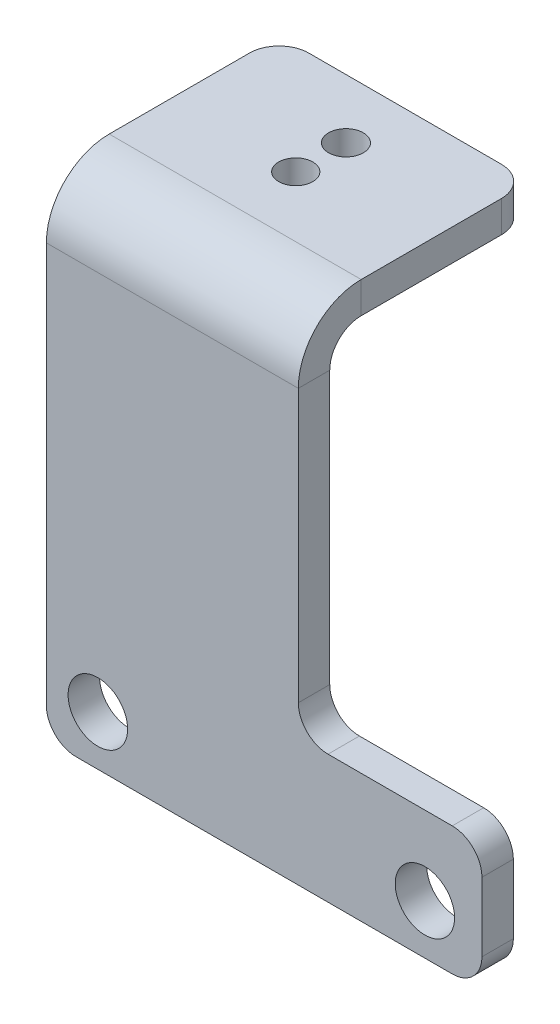
ISO-10303-21;
HEADER;
FILE_DESCRIPTION(('STEP AP214'),'2;1');
FILE_NAME('part.step','',(''),(''),'','','');
FILE_SCHEMA(('AUTOMOTIVE_DESIGN { 1 0 10303 214 1 1 1 1 }'));
ENDSEC;
DATA;
#1=APPLICATION_CONTEXT('core data for automotive mechanical design processes');
#2=APPLICATION_PROTOCOL_DEFINITION('international standard','automotive_design',2000,#1);
#3=PRODUCT_CONTEXT('',#1,'mechanical');
#4=PRODUCT('Part','Part','',(#3));
#5=PRODUCT_RELATED_PRODUCT_CATEGORY('part','',(#4));
#6=PRODUCT_DEFINITION_FORMATION('','',#4);
#7=PRODUCT_DEFINITION_CONTEXT('part definition',#1,'design');
#8=PRODUCT_DEFINITION('design','',#6,#7);
#9=PRODUCT_DEFINITION_SHAPE('','',#8);
#10=(LENGTH_UNIT() NAMED_UNIT(*) SI_UNIT(.MILLI.,.METRE.));
#11=(NAMED_UNIT(*) PLANE_ANGLE_UNIT() SI_UNIT($,.RADIAN.));
#12=(NAMED_UNIT(*) SI_UNIT($,.STERADIAN.) SOLID_ANGLE_UNIT());
#13=UNCERTAINTY_MEASURE_WITH_UNIT(LENGTH_MEASURE(1.E-05),#10,'distance_accuracy_value','');
#14=(GEOMETRIC_REPRESENTATION_CONTEXT(3) GLOBAL_UNCERTAINTY_ASSIGNED_CONTEXT((#13)) GLOBAL_UNIT_ASSIGNED_CONTEXT((#10,
#11,#12)) REPRESENTATION_CONTEXT('',''));
#15=CARTESIAN_POINT('',(0.,0.,0.));
#16=DIRECTION('',(0.,0.,1.));
#17=DIRECTION('',(1.,0.,0.));
#18=AXIS2_PLACEMENT_3D('',#15,#16,#17);
#19=CARTESIAN_POINT('',(3.45480441202994,34.9392859469571,3.175));
#20=DIRECTION('',(1.,0.,0.));
#21=DIRECTION('',(0.,-1.,0.));
#22=AXIS2_PLACEMENT_3D('',#19,#20,#21);
#23=PLANE('',#22);
#24=DIRECTION('',(0.,-1.,0.));
#25=VECTOR('',#24,1.);
#26=CARTESIAN_POINT('',(3.45480441202994,34.9392859469571,3.175));
#27=LINE('',#26,#25);
#28=CARTESIAN_POINT('',(3.45480441202994,28.5892859469571,3.175));
#29=VERTEX_POINT('',#28);
#30=CARTESIAN_POINT('',(3.45480441202994,1.07217449617358,3.175));
#31=VERTEX_POINT('',#30);
#32=EDGE_CURVE('E249',#29,#31,#27,.T.);
#33=ORIENTED_EDGE('',*,*,#32,.T.);
#34=DIRECTION('',(0.,0.,1.));
#35=VECTOR('',#34,1.);
#36=CARTESIAN_POINT('',(3.45480441202994,1.07217449617358,0.));
#37=LINE('',#36,#35);
#38=CARTESIAN_POINT('',(3.45480441202994,1.07217449617358,0.));
#39=VERTEX_POINT('',#38);
#40=EDGE_CURVE('E307',#31,#39,#37,.F.);
#41=ORIENTED_EDGE('',*,*,#40,.T.);
#42=DIRECTION('',(0.,1.,0.));
#43=VECTOR('',#42,1.);
#44=CARTESIAN_POINT('',(3.45480441202994,0.,0.));
#45=LINE('',#44,#43);
#46=CARTESIAN_POINT('',(3.45480441202994,28.5892859469571,0.));
#47=VERTEX_POINT('',#46);
#48=EDGE_CURVE('E260',#47,#39,#45,.F.);
#49=ORIENTED_EDGE('',*,*,#48,.F.);
#50=DIRECTION('',(0.,0.,1.));
#51=VECTOR('',#50,1.);
#52=CARTESIAN_POINT('',(3.45480441202994,28.5892859469571,0.));
#53=LINE('',#52,#51);
#54=EDGE_CURVE('E228',#47,#29,#53,.T.);
#55=ORIENTED_EDGE('',*,*,#54,.T.);
#56=EDGE_LOOP('',(#33,#41,#49,#55));
#57=FACE_BOUND('',#56,.T.);
#58=ADVANCED_FACE('F58',(#57),#23,.T.);
#59=CARTESIAN_POINT('',(0.,0.,3.175));
#60=DIRECTION('',(0.,0.,-1.));
#61=DIRECTION('',(-1.,0.,0.));
#62=AXIS2_PLACEMENT_3D('',#59,#60,#61);
#63=PLANE('',#62);
#64=CARTESIAN_POINT('',(16.2484432255354,-9.86712213835972,3.175));
#65=DIRECTION('',(0.,0.,1.));
#66=DIRECTION('',(1.,0.,0.));
#67=AXIS2_PLACEMENT_3D('',#64,#65,#66);
#68=CIRCLE('',#67,3.);
#69=CARTESIAN_POINT('',(19.2484432255354,-9.86712213835972,3.175));
#70=VERTEX_POINT('',#69);
#71=EDGE_CURVE('E351',#70,#70,#68,.T.);
#72=ORIENTED_EDGE('',*,*,#71,.F.);
#73=EDGE_LOOP('',(#72));
#74=FACE_BOUND('',#73,.T.);
#75=CARTESIAN_POINT('',(-16.8054258844315,-9.86712213835972,3.175));
#76=DIRECTION('',(0.,0.,1.));
#77=DIRECTION('',(1.,0.,0.));
#78=AXIS2_PLACEMENT_3D('',#75,#76,#77);
#79=CIRCLE('',#78,3.00853912662545);
#80=CARTESIAN_POINT('',(-13.796886757806,-9.86712213835972,3.175));
#81=VERTEX_POINT('',#80);
#82=EDGE_CURVE('E345',#81,#81,#79,.T.);
#83=ORIENTED_EDGE('',*,*,#82,.F.);
#84=EDGE_LOOP('',(#83));
#85=FACE_BOUND('',#84,.T.);
#86=DIRECTION('',(0.,-1.,0.));
#87=VECTOR('',#86,1.);
#88=CARTESIAN_POINT('',(-22.0098424053222,-34.9392859469571,3.175));
#89=LINE('',#88,#87);
#90=CARTESIAN_POINT('',(-22.0098424053222,28.5892859469571,3.175));
#91=VERTEX_POINT('',#90);
#92=CARTESIAN_POINT('',(-22.0098424053222,-11.8898519571061,3.175));
#93=VERTEX_POINT('',#92);
#94=EDGE_CURVE('E252',#91,#93,#89,.T.);
#95=ORIENTED_EDGE('',*,*,#94,.T.);
#96=CARTESIAN_POINT('',(-19.0098424053222,-11.8898519571061,3.175));
#97=DIRECTION('',(0.,0.,-1.));
#98=DIRECTION('',(-1.,0.,0.));
#99=AXIS2_PLACEMENT_3D('',#96,#97,#98);
#100=CIRCLE('',#99,3.);
#101=CARTESIAN_POINT('',(-19.0098424053222,-14.8898519571061,3.175));
#102=VERTEX_POINT('',#101);
#103=EDGE_CURVE('E286',#93,#102,#100,.F.);
#104=ORIENTED_EDGE('',*,*,#103,.T.);
#105=DIRECTION('',(-1.,0.,0.));
#106=VECTOR('',#105,1.);
#107=CARTESIAN_POINT('',(-22.0098424053222,-14.8898519571061,3.175));
#108=LINE('',#107,#106);
#109=CARTESIAN_POINT('',(19.0098424053222,-14.8898519571061,3.175));
#110=VERTEX_POINT('',#109);
#111=EDGE_CURVE('E331',#110,#102,#108,.T.);
#112=ORIENTED_EDGE('',*,*,#111,.F.);
#113=CARTESIAN_POINT('',(19.0098424053222,-11.8898519571061,3.175));
#114=DIRECTION('',(0.,0.,-1.));
#115=DIRECTION('',(-1.,0.,0.));
#116=AXIS2_PLACEMENT_3D('',#113,#114,#115);
#117=CIRCLE('',#116,3.);
#118=CARTESIAN_POINT('',(22.0098424053222,-11.8898519571061,3.175));
#119=VERTEX_POINT('',#118);
#120=EDGE_CURVE('E284',#110,#119,#117,.F.);
#121=ORIENTED_EDGE('',*,*,#120,.T.);
#122=DIRECTION('',(0.,1.,0.));
#123=VECTOR('',#122,1.);
#124=CARTESIAN_POINT('',(22.0098424053222,-34.9392859469571,3.175));
#125=LINE('',#124,#123);
#126=CARTESIAN_POINT('',(22.0098424053222,-4.92782550382642,3.175));
#127=VERTEX_POINT('',#126);
#128=EDGE_CURVE('E242',#119,#127,#125,.T.);
#129=ORIENTED_EDGE('',*,*,#128,.T.);
#130=CARTESIAN_POINT('',(19.0098424053222,-4.92782550382642,3.175));
#131=DIRECTION('',(0.,0.,-1.));
#132=DIRECTION('',(-1.,0.,0.));
#133=AXIS2_PLACEMENT_3D('',#130,#131,#132);
#134=CIRCLE('',#133,3.);
#135=CARTESIAN_POINT('',(19.0098424053222,-1.92782550382642,3.175));
#136=VERTEX_POINT('',#135);
#137=EDGE_CURVE('E282',#127,#136,#134,.F.);
#138=ORIENTED_EDGE('',*,*,#137,.T.);
#139=DIRECTION('',(1.,0.,0.));
#140=VECTOR('',#139,1.);
#141=CARTESIAN_POINT('',(3.45480441202994,-1.92782550382642,3.175));
#142=LINE('',#141,#140);
#143=CARTESIAN_POINT('',(6.45480441202994,-1.92782550382642,3.175));
#144=VERTEX_POINT('',#143);
#145=EDGE_CURVE('E245',#144,#136,#142,.T.);
#146=ORIENTED_EDGE('',*,*,#145,.F.);
#147=CARTESIAN_POINT('',(6.45480441202994,1.07217449617358,3.175));
#148=DIRECTION('',(0.,0.,-1.));
#149=DIRECTION('',(-1.,0.,0.));
#150=AXIS2_PLACEMENT_3D('',#147,#148,#149);
#151=CIRCLE('',#150,3.);
#152=EDGE_CURVE('E66',#144,#31,#151,.T.);
#153=ORIENTED_EDGE('',*,*,#152,.T.);
#154=ORIENTED_EDGE('',*,*,#32,.F.);
#155=DIRECTION('',(1.,0.,0.));
#156=VECTOR('',#155,1.);
#157=CARTESIAN_POINT('',(3.45480441202994,28.5892859469571,3.175));
#158=LINE('',#157,#156);
#159=EDGE_CURVE('E180',#29,#91,#158,.F.);
#160=ORIENTED_EDGE('',*,*,#159,.T.);
#161=EDGE_LOOP('',(#95,#104,#112,#121,#129,#138,#146,#153,#154,#160));
#162=FACE_BOUND('',#161,.T.);
#163=ADVANCED_FACE('F311',(#74,#85,#162),#63,.F.);
#164=CARTESIAN_POINT('',(0.,0.,0.));
#165=DIRECTION('',(0.,0.,-1.));
#166=DIRECTION('',(-1.,0.,0.));
#167=AXIS2_PLACEMENT_3D('',#164,#165,#166);
#168=PLANE('',#167);
#169=CARTESIAN_POINT('',(16.2484432255354,-9.86712213835972,0.));
#170=DIRECTION('',(0.,0.,1.));
#171=DIRECTION('',(1.,0.,0.));
#172=AXIS2_PLACEMENT_3D('',#169,#170,#171);
#173=CIRCLE('',#172,3.);
#174=CARTESIAN_POINT('',(19.2484432255354,-9.86712213835972,0.));
#175=VERTEX_POINT('',#174);
#176=EDGE_CURVE('E348',#175,#175,#173,.T.);
#177=ORIENTED_EDGE('',*,*,#176,.T.);
#178=EDGE_LOOP('',(#177));
#179=FACE_BOUND('',#178,.T.);
#180=CARTESIAN_POINT('',(-16.8054258844315,-9.86712213835972,0.));
#181=DIRECTION('',(0.,0.,1.));
#182=DIRECTION('',(1.,0.,0.));
#183=AXIS2_PLACEMENT_3D('',#180,#181,#182);
#184=CIRCLE('',#183,3.00853912662545);
#185=CARTESIAN_POINT('',(-13.796886757806,-9.86712213835972,0.));
#186=VERTEX_POINT('',#185);
#187=EDGE_CURVE('E342',#186,#186,#184,.T.);
#188=ORIENTED_EDGE('',*,*,#187,.T.);
#189=EDGE_LOOP('',(#188));
#190=FACE_BOUND('',#189,.T.);
#191=DIRECTION('',(-1.,0.,0.));
#192=VECTOR('',#191,1.);
#193=CARTESIAN_POINT('',(-22.0098424053222,-14.8898519571061,0.));
#194=LINE('',#193,#192);
#195=CARTESIAN_POINT('',(19.0098424053222,-14.8898519571061,0.));
#196=VERTEX_POINT('',#195);
#197=CARTESIAN_POINT('',(-19.0098424053222,-14.8898519571061,0.));
#198=VERTEX_POINT('',#197);
#199=EDGE_CURVE('E225',#196,#198,#194,.T.);
#200=ORIENTED_EDGE('',*,*,#199,.T.);
#201=CARTESIAN_POINT('',(-19.0098424053222,-11.8898519571061,0.));
#202=DIRECTION('',(0.,0.,-1.));
#203=DIRECTION('',(-1.,0.,0.));
#204=AXIS2_PLACEMENT_3D('',#201,#202,#203);
#205=CIRCLE('',#204,3.);
#206=CARTESIAN_POINT('',(-22.0098424053222,-11.8898519571061,0.));
#207=VERTEX_POINT('',#206);
#208=EDGE_CURVE('E296',#198,#207,#205,.T.);
#209=ORIENTED_EDGE('',*,*,#208,.T.);
#210=DIRECTION('',(0.,1.,0.));
#211=VECTOR('',#210,1.);
#212=CARTESIAN_POINT('',(-22.0098424053222,0.,0.));
#213=LINE('',#212,#211);
#214=CARTESIAN_POINT('',(-22.0098424053222,28.5892859469571,0.));
#215=VERTEX_POINT('',#214);
#216=EDGE_CURVE('E246',#215,#207,#213,.F.);
#217=ORIENTED_EDGE('',*,*,#216,.F.);
#218=DIRECTION('',(1.,0.,0.));
#219=VECTOR('',#218,1.);
#220=CARTESIAN_POINT('',(3.45480441202994,28.5892859469571,0.));
#221=LINE('',#220,#219);
#222=EDGE_CURVE('E232',#47,#215,#221,.F.);
#223=ORIENTED_EDGE('',*,*,#222,.F.);
#224=ORIENTED_EDGE('',*,*,#48,.T.);
#225=CARTESIAN_POINT('',(6.45480441202994,1.07217449617358,0.));
#226=DIRECTION('',(0.,0.,-1.));
#227=DIRECTION('',(-1.,0.,0.));
#228=AXIS2_PLACEMENT_3D('',#225,#226,#227);
#229=CIRCLE('',#228,3.);
#230=CARTESIAN_POINT('',(6.45480441202994,-1.92782550382642,0.));
#231=VERTEX_POINT('',#230);
#232=EDGE_CURVE('E13',#39,#231,#229,.F.);
#233=ORIENTED_EDGE('',*,*,#232,.T.);
#234=DIRECTION('',(-1.,0.,0.));
#235=VECTOR('',#234,1.);
#236=CARTESIAN_POINT('',(0.,-1.92782550382642,0.));
#237=LINE('',#236,#235);
#238=CARTESIAN_POINT('',(19.0098424053222,-1.92782550382642,0.));
#239=VERTEX_POINT('',#238);
#240=EDGE_CURVE('E257',#231,#239,#237,.F.);
#241=ORIENTED_EDGE('',*,*,#240,.T.);
#242=CARTESIAN_POINT('',(19.0098424053222,-4.92782550382642,0.));
#243=DIRECTION('',(0.,0.,-1.));
#244=DIRECTION('',(-1.,0.,0.));
#245=AXIS2_PLACEMENT_3D('',#242,#243,#244);
#246=CIRCLE('',#245,3.);
#247=CARTESIAN_POINT('',(22.0098424053222,-4.92782550382642,0.));
#248=VERTEX_POINT('',#247);
#249=EDGE_CURVE('E73',#239,#248,#246,.T.);
#250=ORIENTED_EDGE('',*,*,#249,.T.);
#251=DIRECTION('',(0.,1.,0.));
#252=VECTOR('',#251,1.);
#253=CARTESIAN_POINT('',(22.0098424053222,0.,0.));
#254=LINE('',#253,#252);
#255=CARTESIAN_POINT('',(22.0098424053222,-11.8898519571061,0.));
#256=VERTEX_POINT('',#255);
#257=EDGE_CURVE('E239',#256,#248,#254,.T.);
#258=ORIENTED_EDGE('',*,*,#257,.F.);
#259=CARTESIAN_POINT('',(19.0098424053222,-11.8898519571061,0.));
#260=DIRECTION('',(0.,0.,-1.));
#261=DIRECTION('',(-1.,0.,0.));
#262=AXIS2_PLACEMENT_3D('',#259,#260,#261);
#263=CIRCLE('',#262,3.);
#264=EDGE_CURVE('E294',#256,#196,#263,.T.);
#265=ORIENTED_EDGE('',*,*,#264,.T.);
#266=EDGE_LOOP('',(#200,#209,#217,#223,#224,#233,#241,#250,#258,#265));
#267=FACE_BOUND('',#266,.T.);
#268=ADVANCED_FACE('F321',(#179,#190,#267),#168,.T.);
#269=CARTESIAN_POINT('',(-22.0098424053222,-34.9392859469571,3.175));
#270=DIRECTION('',(1.,0.,0.));
#271=DIRECTION('',(0.,-1.,0.));
#272=AXIS2_PLACEMENT_3D('',#269,#270,#271);
#273=PLANE('',#272);
#274=ORIENTED_EDGE('',*,*,#216,.T.);
#275=DIRECTION('',(0.,0.,1.));
#276=VECTOR('',#275,1.);
#277=CARTESIAN_POINT('',(-22.0098424053222,-11.8898519571061,3.175));
#278=LINE('',#277,#276);
#279=EDGE_CURVE('E279',#207,#93,#278,.T.);
#280=ORIENTED_EDGE('',*,*,#279,.T.);
#281=ORIENTED_EDGE('',*,*,#94,.F.);
#282=DIRECTION('',(0.,0.,1.));
#283=VECTOR('',#282,1.);
#284=CARTESIAN_POINT('',(-22.0098424053222,28.5892859469571,0.));
#285=LINE('',#284,#283);
#286=EDGE_CURVE('E236',#215,#91,#285,.T.);
#287=ORIENTED_EDGE('',*,*,#286,.F.);
#288=EDGE_LOOP('',(#274,#280,#281,#287));
#289=FACE_BOUND('',#288,.T.);
#290=ADVANCED_FACE('F405',(#289),#273,.F.);
#291=CARTESIAN_POINT('',(22.0098424053222,-34.9392859469571,3.175));
#292=DIRECTION('',(-1.,0.,0.));
#293=DIRECTION('',(0.,1.,0.));
#294=AXIS2_PLACEMENT_3D('',#291,#292,#293);
#295=PLANE('',#294);
#296=ORIENTED_EDGE('',*,*,#128,.F.);
#297=DIRECTION('',(0.,0.,1.));
#298=VECTOR('',#297,1.);
#299=CARTESIAN_POINT('',(22.0098424053222,-11.8898519571061,0.));
#300=LINE('',#299,#298);
#301=EDGE_CURVE('E80',#119,#256,#300,.F.);
#302=ORIENTED_EDGE('',*,*,#301,.T.);
#303=ORIENTED_EDGE('',*,*,#257,.T.);
#304=DIRECTION('',(0.,0.,1.));
#305=VECTOR('',#304,1.);
#306=CARTESIAN_POINT('',(22.0098424053222,-4.92782550382642,3.175));
#307=LINE('',#306,#305);
#308=EDGE_CURVE('E298',#248,#127,#307,.T.);
#309=ORIENTED_EDGE('',*,*,#308,.T.);
#310=EDGE_LOOP('',(#296,#302,#303,#309));
#311=FACE_BOUND('',#310,.T.);
#312=ADVANCED_FACE('F328',(#311),#295,.F.);
#313=CARTESIAN_POINT('',(3.45480441202994,-1.92782550382642,3.175));
#314=DIRECTION('',(0.,1.,0.));
#315=DIRECTION('',(1.,0.,0.));
#316=AXIS2_PLACEMENT_3D('',#313,#314,#315);
#317=PLANE('',#316);
#318=ORIENTED_EDGE('',*,*,#240,.F.);
#319=DIRECTION('',(0.,0.,1.));
#320=VECTOR('',#319,1.);
#321=CARTESIAN_POINT('',(6.45480441202994,-1.92782550382642,3.175));
#322=LINE('',#321,#320);
#323=EDGE_CURVE('E304',#231,#144,#322,.T.);
#324=ORIENTED_EDGE('',*,*,#323,.T.);
#325=ORIENTED_EDGE('',*,*,#145,.T.);
#326=DIRECTION('',(0.,0.,-1.));
#327=VECTOR('',#326,1.);
#328=CARTESIAN_POINT('',(19.0098424053222,-1.92782550382642,3.175));
#329=LINE('',#328,#327);
#330=EDGE_CURVE('E302',#136,#239,#329,.T.);
#331=ORIENTED_EDGE('',*,*,#330,.T.);
#332=EDGE_LOOP('',(#318,#324,#325,#331));
#333=FACE_BOUND('',#332,.T.);
#334=ADVANCED_FACE('F323',(#333),#317,.T.);
#335=CARTESIAN_POINT('',(-22.0098424053222,28.5892859469571,-3.175));
#336=DIRECTION('',(-1.,0.,0.));
#337=DIRECTION('',(0.,0.,1.));
#338=AXIS2_PLACEMENT_3D('',#335,#336,#337);
#339=PLANE('',#338);
#340=DIRECTION('',(0.,-1.,0.));
#341=VECTOR('',#340,1.);
#342=CARTESIAN_POINT('',(-22.0098424053222,34.9392859469571,-3.17499999999998));
#343=LINE('',#342,#341);
#344=CARTESIAN_POINT('',(-22.0098424053222,31.7642859469571,-3.17499999999999));
#345=VERTEX_POINT('',#344);
#346=CARTESIAN_POINT('',(-22.0098424053222,34.9392859469571,-3.17499999999998));
#347=VERTEX_POINT('',#346);
#348=EDGE_CURVE('E222',#345,#347,#343,.F.);
#349=ORIENTED_EDGE('',*,*,#348,.F.);
#350=CARTESIAN_POINT('',(-22.0098424053222,28.5892859469571,-3.175));
#351=DIRECTION('',(1.,0.,0.));
#352=DIRECTION('',(0.,0.,-1.));
#353=AXIS2_PLACEMENT_3D('',#350,#351,#352);
#354=CIRCLE('',#353,3.175);
#355=EDGE_CURVE('E183',#215,#345,#354,.F.);
#356=ORIENTED_EDGE('',*,*,#355,.F.);
#357=ORIENTED_EDGE('',*,*,#286,.T.);
#358=CARTESIAN_POINT('',(-22.0098424053222,28.5892859469571,-3.175));
#359=DIRECTION('',(1.,0.,0.));
#360=DIRECTION('',(0.,0.,-1.));
#361=AXIS2_PLACEMENT_3D('',#358,#359,#360);
#362=CIRCLE('',#361,6.35);
#363=EDGE_CURVE('E227',#91,#347,#362,.F.);
#364=ORIENTED_EDGE('',*,*,#363,.T.);
#365=EDGE_LOOP('',(#349,#356,#357,#364));
#366=FACE_BOUND('',#365,.T.);
#367=ADVANCED_FACE('F409',(#366),#339,.T.);
#368=CARTESIAN_POINT('',(3.45480441202994,28.5892859469571,-3.175));
#369=DIRECTION('',(-1.,0.,0.));
#370=DIRECTION('',(0.,0.,1.));
#371=AXIS2_PLACEMENT_3D('',#368,#369,#370);
#372=PLANE('',#371);
#373=CARTESIAN_POINT('',(3.45480441202994,28.5892859469571,-3.175));
#374=DIRECTION('',(1.,0.,0.));
#375=DIRECTION('',(0.,0.,-1.));
#376=AXIS2_PLACEMENT_3D('',#373,#374,#375);
#377=CIRCLE('',#376,3.175);
#378=CARTESIAN_POINT('',(3.45480441202994,31.7642859469571,-3.17499999999999));
#379=VERTEX_POINT('',#378);
#380=EDGE_CURVE('E190',#379,#47,#377,.T.);
#381=ORIENTED_EDGE('',*,*,#380,.F.);
#382=DIRECTION('',(0.,-1.,0.));
#383=VECTOR('',#382,1.);
#384=CARTESIAN_POINT('',(3.45480441202994,31.7642859469571,-3.17499999999999));
#385=LINE('',#384,#383);
#386=CARTESIAN_POINT('',(3.45480441202994,34.9392859469571,-3.17499999999998));
#387=VERTEX_POINT('',#386);
#388=EDGE_CURVE('E187',#379,#387,#385,.F.);
#389=ORIENTED_EDGE('',*,*,#388,.T.);
#390=CARTESIAN_POINT('',(3.45480441202994,28.5892859469571,-3.175));
#391=DIRECTION('',(1.,0.,0.));
#392=DIRECTION('',(0.,0.,-1.));
#393=AXIS2_PLACEMENT_3D('',#390,#391,#392);
#394=CIRCLE('',#393,6.35);
#395=EDGE_CURVE('E173',#387,#29,#394,.T.);
#396=ORIENTED_EDGE('',*,*,#395,.T.);
#397=ORIENTED_EDGE('',*,*,#54,.F.);
#398=EDGE_LOOP('',(#381,#389,#396,#397));
#399=FACE_BOUND('',#398,.T.);
#400=ADVANCED_FACE('F188',(#399),#372,.F.);
#401=CARTESIAN_POINT('',(3.45480441202994,28.5892859469571,-3.175));
#402=DIRECTION('',(1.,0.,0.));
#403=DIRECTION('',(0.,1.,0.));
#404=AXIS2_PLACEMENT_3D('',#401,#402,#403);
#405=CYLINDRICAL_SURFACE('',#404,6.35);
#406=ORIENTED_EDGE('',*,*,#159,.F.);
#407=ORIENTED_EDGE('',*,*,#395,.F.);
#408=DIRECTION('',(1.,0.,0.));
#409=VECTOR('',#408,1.);
#410=CARTESIAN_POINT('',(-22.0098424053222,34.9392859469571,-3.17499999999998));
#411=LINE('',#410,#409);
#412=EDGE_CURVE('E178',#387,#347,#411,.F.);
#413=ORIENTED_EDGE('',*,*,#412,.T.);
#414=ORIENTED_EDGE('',*,*,#363,.F.);
#415=EDGE_LOOP('',(#406,#407,#413,#414));
#416=FACE_BOUND('',#415,.T.);
#417=ADVANCED_FACE('F175',(#416),#405,.T.);
#418=CARTESIAN_POINT('',(3.45480441202994,28.5892859469571,-3.175));
#419=DIRECTION('',(1.,0.,0.));
#420=DIRECTION('',(0.,1.,0.));
#421=AXIS2_PLACEMENT_3D('',#418,#419,#420);
#422=CYLINDRICAL_SURFACE('',#421,3.175);
#423=ORIENTED_EDGE('',*,*,#222,.T.);
#424=ORIENTED_EDGE('',*,*,#355,.T.);
#425=DIRECTION('',(1.,0.,0.));
#426=VECTOR('',#425,1.);
#427=CARTESIAN_POINT('',(-22.0098424053222,31.7642859469571,-3.17499999999999));
#428=LINE('',#427,#426);
#429=EDGE_CURVE('E195',#345,#379,#428,.T.);
#430=ORIENTED_EDGE('',*,*,#429,.T.);
#431=ORIENTED_EDGE('',*,*,#380,.T.);
#432=EDGE_LOOP('',(#423,#424,#430,#431));
#433=FACE_BOUND('',#432,.T.);
#434=ADVANCED_FACE('F446',(#433),#422,.F.);
#435=CARTESIAN_POINT('',(3.45480441202994,34.9392859469571,-20.35));
#436=DIRECTION('',(-1.,0.,0.));
#437=DIRECTION('',(0.,0.,1.));
#438=AXIS2_PLACEMENT_3D('',#435,#436,#437);
#439=PLANE('',#438);
#440=DIRECTION('',(0.,0.,1.));
#441=VECTOR('',#440,1.);
#442=CARTESIAN_POINT('',(3.45480441202994,31.7642859469571,-20.35));
#443=LINE('',#442,#441);
#444=CARTESIAN_POINT('',(3.45480441202994,31.7642859469571,-17.35));
#445=VERTEX_POINT('',#444);
#446=EDGE_CURVE('E205',#379,#445,#443,.F.);
#447=ORIENTED_EDGE('',*,*,#446,.T.);
#448=DIRECTION('',(0.,-1.,0.));
#449=VECTOR('',#448,1.);
#450=CARTESIAN_POINT('',(3.45480441202994,34.9392859469571,-17.35));
#451=LINE('',#450,#449);
#452=CARTESIAN_POINT('',(3.45480441202994,34.9392859469571,-17.35));
#453=VERTEX_POINT('',#452);
#454=EDGE_CURVE('E209',#445,#453,#451,.F.);
#455=ORIENTED_EDGE('',*,*,#454,.T.);
#456=DIRECTION('',(0.,0.,-1.));
#457=VECTOR('',#456,1.);
#458=CARTESIAN_POINT('',(3.45480441202994,34.9392859469571,1.30220587532995E-13));
#459=LINE('',#458,#457);
#460=EDGE_CURVE('E201',#387,#453,#459,.T.);
#461=ORIENTED_EDGE('',*,*,#460,.F.);
#462=ORIENTED_EDGE('',*,*,#388,.F.);
#463=EDGE_LOOP('',(#447,#455,#461,#462));
#464=FACE_BOUND('',#463,.T.);
#465=ADVANCED_FACE('F207',(#464),#439,.F.);
#466=CARTESIAN_POINT('',(-22.0098424053222,34.9392859469571,0.));
#467=DIRECTION('',(1.,0.,0.));
#468=DIRECTION('',(0.,0.,-1.));
#469=AXIS2_PLACEMENT_3D('',#466,#467,#468);
#470=PLANE('',#469);
#471=DIRECTION('',(0.,0.,1.));
#472=VECTOR('',#471,1.);
#473=CARTESIAN_POINT('',(-22.0098424053222,34.9392859469571,1.30220587532995E-13));
#474=LINE('',#473,#472);
#475=CARTESIAN_POINT('',(-22.0098424053222,34.9392859469571,-17.35));
#476=VERTEX_POINT('',#475);
#477=EDGE_CURVE('E204',#476,#347,#474,.T.);
#478=ORIENTED_EDGE('',*,*,#477,.F.);
#479=DIRECTION('',(0.,-1.,0.));
#480=VECTOR('',#479,1.);
#481=CARTESIAN_POINT('',(-22.0098424053222,34.9392859469571,-17.35));
#482=LINE('',#481,#480);
#483=CARTESIAN_POINT('',(-22.0098424053222,31.7642859469571,-17.35));
#484=VERTEX_POINT('',#483);
#485=EDGE_CURVE('E255',#476,#484,#482,.T.);
#486=ORIENTED_EDGE('',*,*,#485,.T.);
#487=DIRECTION('',(0.,0.,-1.));
#488=VECTOR('',#487,1.);
#489=CARTESIAN_POINT('',(-22.0098424053222,31.7642859469571,0.));
#490=LINE('',#489,#488);
#491=EDGE_CURVE('E211',#484,#345,#490,.F.);
#492=ORIENTED_EDGE('',*,*,#491,.T.);
#493=ORIENTED_EDGE('',*,*,#348,.T.);
#494=EDGE_LOOP('',(#478,#486,#492,#493));
#495=FACE_BOUND('',#494,.T.);
#496=ADVANCED_FACE('F381',(#495),#470,.F.);
#497=CARTESIAN_POINT('',(0.,34.9392859469571,1.30220587532995E-13));
#498=DIRECTION('',(0.,-1.,0.));
#499=DIRECTION('',(0.,0.,-1.));
#500=AXIS2_PLACEMENT_3D('',#497,#498,#499);
#501=PLANE('',#500);
#502=CARTESIAN_POINT('',(-9.27751899664612,34.9392859469571,-14.3719641710599));
#503=DIRECTION('',(0.,1.,0.));
#504=DIRECTION('',(0.,0.,1.));
#505=AXIS2_PLACEMENT_3D('',#502,#503,#504);
#506=CIRCLE('',#505,1.75498583869249);
#507=CARTESIAN_POINT('',(-9.27751899664612,34.9392859469571,-12.6169783323674));
#508=VERTEX_POINT('',#507);
#509=EDGE_CURVE('E363',#508,#508,#506,.T.);
#510=ORIENTED_EDGE('',*,*,#509,.F.);
#511=EDGE_LOOP('',(#510));
#512=FACE_BOUND('',#511,.T.);
#513=CARTESIAN_POINT('',(-9.27751899664612,34.9392859469571,-9.29602935636341));
#514=DIRECTION('',(0.,1.,0.));
#515=DIRECTION('',(0.,0.,1.));
#516=AXIS2_PLACEMENT_3D('',#513,#514,#515);
#517=CIRCLE('',#516,1.72409017389805);
#518=CARTESIAN_POINT('',(-9.27751899664612,34.9392859469571,-7.57193918246536));
#519=VERTEX_POINT('',#518);
#520=EDGE_CURVE('E357',#519,#519,#517,.T.);
#521=ORIENTED_EDGE('',*,*,#520,.F.);
#522=EDGE_LOOP('',(#521));
#523=FACE_BOUND('',#522,.T.);
#524=DIRECTION('',(-1.,0.,0.));
#525=VECTOR('',#524,1.);
#526=CARTESIAN_POINT('',(0.,34.9392859469571,-20.35));
#527=LINE('',#526,#525);
#528=CARTESIAN_POINT('',(0.454804412029944,34.9392859469571,-20.35));
#529=VERTEX_POINT('',#528);
#530=CARTESIAN_POINT('',(-19.0098424053222,34.9392859469571,-20.35));
#531=VERTEX_POINT('',#530);
#532=EDGE_CURVE('E210',#529,#531,#527,.T.);
#533=ORIENTED_EDGE('',*,*,#532,.T.);
#534=CARTESIAN_POINT('',(-19.0098424053222,34.9392859469571,-17.35));
#535=DIRECTION('',(0.,-1.,0.));
#536=DIRECTION('',(0.,0.,-1.));
#537=AXIS2_PLACEMENT_3D('',#534,#535,#536);
#538=CIRCLE('',#537,3.);
#539=EDGE_CURVE('E277',#531,#476,#538,.F.);
#540=ORIENTED_EDGE('',*,*,#539,.T.);
#541=ORIENTED_EDGE('',*,*,#477,.T.);
#542=ORIENTED_EDGE('',*,*,#412,.F.);
#543=ORIENTED_EDGE('',*,*,#460,.T.);
#544=CARTESIAN_POINT('',(0.454804412029944,34.9392859469571,-17.35));
#545=DIRECTION('',(0.,-1.,0.));
#546=DIRECTION('',(0.,0.,-1.));
#547=AXIS2_PLACEMENT_3D('',#544,#545,#546);
#548=CIRCLE('',#547,3.);
#549=EDGE_CURVE('E275',#453,#529,#548,.F.);
#550=ORIENTED_EDGE('',*,*,#549,.T.);
#551=EDGE_LOOP('',(#533,#540,#541,#542,#543,#550));
#552=FACE_BOUND('',#551,.T.);
#553=ADVANCED_FACE('F200',(#512,#523,#552),#501,.F.);
#554=CARTESIAN_POINT('',(0.,31.7642859469571,1.19135134282168E-13));
#555=DIRECTION('',(0.,-1.,0.));
#556=DIRECTION('',(0.,0.,-1.));
#557=AXIS2_PLACEMENT_3D('',#554,#555,#556);
#558=PLANE('',#557);
#559=CARTESIAN_POINT('',(-9.27751899664612,31.7642859469571,-14.3719641710599));
#560=DIRECTION('',(0.,1.,0.));
#561=DIRECTION('',(0.,0.,1.));
#562=AXIS2_PLACEMENT_3D('',#559,#560,#561);
#563=CIRCLE('',#562,1.75498583869249);
#564=CARTESIAN_POINT('',(-9.27751899664612,31.7642859469571,-12.6169783323674));
#565=VERTEX_POINT('',#564);
#566=EDGE_CURVE('E360',#565,#565,#563,.T.);
#567=ORIENTED_EDGE('',*,*,#566,.T.);
#568=EDGE_LOOP('',(#567));
#569=FACE_BOUND('',#568,.T.);
#570=CARTESIAN_POINT('',(-9.27751899664612,31.7642859469571,-9.29602935636342));
#571=DIRECTION('',(0.,1.,0.));
#572=DIRECTION('',(0.,0.,1.));
#573=AXIS2_PLACEMENT_3D('',#570,#571,#572);
#574=CIRCLE('',#573,1.72409017389805);
#575=CARTESIAN_POINT('',(-9.27751899664612,31.7642859469571,-7.57193918246537));
#576=VERTEX_POINT('',#575);
#577=EDGE_CURVE('E354',#576,#576,#574,.T.);
#578=ORIENTED_EDGE('',*,*,#577,.T.);
#579=EDGE_LOOP('',(#578));
#580=FACE_BOUND('',#579,.T.);
#581=ORIENTED_EDGE('',*,*,#491,.F.);
#582=CARTESIAN_POINT('',(-19.0098424053222,31.7642859469571,-17.35));
#583=DIRECTION('',(0.,-1.,0.));
#584=DIRECTION('',(0.,0.,-1.));
#585=AXIS2_PLACEMENT_3D('',#582,#583,#584);
#586=CIRCLE('',#585,3.);
#587=CARTESIAN_POINT('',(-19.0098424053222,31.7642859469571,-20.35));
#588=VERTEX_POINT('',#587);
#589=EDGE_CURVE('E268',#484,#588,#586,.T.);
#590=ORIENTED_EDGE('',*,*,#589,.T.);
#591=DIRECTION('',(1.,0.,0.));
#592=VECTOR('',#591,1.);
#593=CARTESIAN_POINT('',(-22.0098424053222,31.7642859469571,-20.35));
#594=LINE('',#593,#592);
#595=CARTESIAN_POINT('',(0.454804412029944,31.7642859469571,-20.35));
#596=VERTEX_POINT('',#595);
#597=EDGE_CURVE('E214',#596,#588,#594,.F.);
#598=ORIENTED_EDGE('',*,*,#597,.F.);
#599=CARTESIAN_POINT('',(0.454804412029944,31.7642859469571,-17.35));
#600=DIRECTION('',(0.,-1.,0.));
#601=DIRECTION('',(0.,0.,-1.));
#602=AXIS2_PLACEMENT_3D('',#599,#600,#601);
#603=CIRCLE('',#602,3.);
#604=EDGE_CURVE('E266',#596,#445,#603,.T.);
#605=ORIENTED_EDGE('',*,*,#604,.T.);
#606=ORIENTED_EDGE('',*,*,#446,.F.);
#607=ORIENTED_EDGE('',*,*,#429,.F.);
#608=EDGE_LOOP('',(#581,#590,#598,#605,#606,#607));
#609=FACE_BOUND('',#608,.T.);
#610=ADVANCED_FACE('F369',(#569,#580,#609),#558,.T.);
#611=CARTESIAN_POINT('',(-22.0098424053222,34.9392859469571,-20.35));
#612=DIRECTION('',(0.,0.,1.));
#613=DIRECTION('',(0.,-1.,0.));
#614=AXIS2_PLACEMENT_3D('',#611,#612,#613);
#615=PLANE('',#614);
#616=ORIENTED_EDGE('',*,*,#597,.T.);
#617=DIRECTION('',(0.,-1.,0.));
#618=VECTOR('',#617,1.);
#619=CARTESIAN_POINT('',(-19.0098424053222,34.9392859469571,-20.35));
#620=LINE('',#619,#618);
#621=EDGE_CURVE('E273',#588,#531,#620,.F.);
#622=ORIENTED_EDGE('',*,*,#621,.T.);
#623=ORIENTED_EDGE('',*,*,#532,.F.);
#624=DIRECTION('',(0.,-1.,0.));
#625=VECTOR('',#624,1.);
#626=CARTESIAN_POINT('',(0.454804412029944,34.9392859469571,-20.35));
#627=LINE('',#626,#625);
#628=EDGE_CURVE('E270',#529,#596,#627,.T.);
#629=ORIENTED_EDGE('',*,*,#628,.T.);
#630=EDGE_LOOP('',(#616,#622,#623,#629));
#631=FACE_BOUND('',#630,.T.);
#632=ADVANCED_FACE('F435',(#631),#615,.F.);
#633=CARTESIAN_POINT('',(-22.0098424053222,-14.8898519571061,0.));
#634=DIRECTION('',(0.,1.,0.));
#635=DIRECTION('',(0.,0.,1.));
#636=AXIS2_PLACEMENT_3D('',#633,#634,#635);
#637=PLANE('',#636);
#638=ORIENTED_EDGE('',*,*,#111,.T.);
#639=DIRECTION('',(0.,0.,-1.));
#640=VECTOR('',#639,1.);
#641=CARTESIAN_POINT('',(-19.0098424053222,-14.8898519571061,0.));
#642=LINE('',#641,#640);
#643=EDGE_CURVE('E291',#102,#198,#642,.T.);
#644=ORIENTED_EDGE('',*,*,#643,.T.);
#645=ORIENTED_EDGE('',*,*,#199,.F.);
#646=DIRECTION('',(0.,0.,-1.));
#647=VECTOR('',#646,1.);
#648=CARTESIAN_POINT('',(19.0098424053222,-14.8898519571061,3.175));
#649=LINE('',#648,#647);
#650=EDGE_CURVE('E288',#196,#110,#649,.F.);
#651=ORIENTED_EDGE('',*,*,#650,.T.);
#652=EDGE_LOOP('',(#638,#644,#645,#651));
#653=FACE_BOUND('',#652,.T.);
#654=ADVANCED_FACE('F338',(#653),#637,.F.);
#655=CARTESIAN_POINT('',(-19.0098424053222,34.9392859469571,-17.35));
#656=DIRECTION('',(0.,-1.,0.));
#657=DIRECTION('',(0.,0.,-1.));
#658=AXIS2_PLACEMENT_3D('',#655,#656,#657);
#659=CYLINDRICAL_SURFACE('',#658,3.);
#660=ORIENTED_EDGE('',*,*,#539,.F.);
#661=ORIENTED_EDGE('',*,*,#621,.F.);
#662=ORIENTED_EDGE('',*,*,#589,.F.);
#663=ORIENTED_EDGE('',*,*,#485,.F.);
#664=EDGE_LOOP('',(#660,#661,#662,#663));
#665=FACE_BOUND('',#664,.T.);
#666=ADVANCED_FACE('F410',(#665),#659,.T.);
#667=CARTESIAN_POINT('',(-19.0098424053222,-11.8898519571061,3.175));
#668=DIRECTION('',(0.,0.,1.));
#669=DIRECTION('',(1.,0.,0.));
#670=AXIS2_PLACEMENT_3D('',#667,#668,#669);
#671=CYLINDRICAL_SURFACE('',#670,3.);
#672=ORIENTED_EDGE('',*,*,#208,.F.);
#673=ORIENTED_EDGE('',*,*,#643,.F.);
#674=ORIENTED_EDGE('',*,*,#103,.F.);
#675=ORIENTED_EDGE('',*,*,#279,.F.);
#676=EDGE_LOOP('',(#672,#673,#674,#675));
#677=FACE_BOUND('',#676,.T.);
#678=ADVANCED_FACE('F413',(#677),#671,.T.);
#679=CARTESIAN_POINT('',(19.0098424053222,-11.8898519571061,0.));
#680=DIRECTION('',(0.,0.,1.));
#681=DIRECTION('',(1.,0.,0.));
#682=AXIS2_PLACEMENT_3D('',#679,#680,#681);
#683=CYLINDRICAL_SURFACE('',#682,3.);
#684=ORIENTED_EDGE('',*,*,#264,.F.);
#685=ORIENTED_EDGE('',*,*,#301,.F.);
#686=ORIENTED_EDGE('',*,*,#120,.F.);
#687=ORIENTED_EDGE('',*,*,#650,.F.);
#688=EDGE_LOOP('',(#684,#685,#686,#687));
#689=FACE_BOUND('',#688,.T.);
#690=ADVANCED_FACE('F335',(#689),#683,.T.);
#691=CARTESIAN_POINT('',(6.45480441202994,1.07217449617358,3.175));
#692=DIRECTION('',(0.,0.,-1.));
#693=DIRECTION('',(-1.,0.,0.));
#694=AXIS2_PLACEMENT_3D('',#691,#692,#693);
#695=CYLINDRICAL_SURFACE('',#694,3.);
#696=ORIENTED_EDGE('',*,*,#232,.F.);
#697=ORIENTED_EDGE('',*,*,#40,.F.);
#698=ORIENTED_EDGE('',*,*,#152,.F.);
#699=ORIENTED_EDGE('',*,*,#323,.F.);
#700=EDGE_LOOP('',(#696,#697,#698,#699));
#701=FACE_BOUND('',#700,.T.);
#702=ADVANCED_FACE('F318',(#701),#695,.F.);
#703=CARTESIAN_POINT('',(19.0098424053222,-4.92782550382642,3.175));
#704=DIRECTION('',(0.,0.,-1.));
#705=DIRECTION('',(-1.,0.,0.));
#706=AXIS2_PLACEMENT_3D('',#703,#704,#705);
#707=CYLINDRICAL_SURFACE('',#706,3.);
#708=ORIENTED_EDGE('',*,*,#249,.F.);
#709=ORIENTED_EDGE('',*,*,#330,.F.);
#710=ORIENTED_EDGE('',*,*,#137,.F.);
#711=ORIENTED_EDGE('',*,*,#308,.F.);
#712=EDGE_LOOP('',(#708,#709,#710,#711));
#713=FACE_BOUND('',#712,.T.);
#714=ADVANCED_FACE('F326',(#713),#707,.T.);
#715=CARTESIAN_POINT('',(0.454804412029944,34.9392859469571,-17.35));
#716=DIRECTION('',(0.,-1.,0.));
#717=DIRECTION('',(0.,0.,-1.));
#718=AXIS2_PLACEMENT_3D('',#715,#716,#717);
#719=CYLINDRICAL_SURFACE('',#718,3.);
#720=ORIENTED_EDGE('',*,*,#549,.F.);
#721=ORIENTED_EDGE('',*,*,#454,.F.);
#722=ORIENTED_EDGE('',*,*,#604,.F.);
#723=ORIENTED_EDGE('',*,*,#628,.F.);
#724=EDGE_LOOP('',(#720,#721,#722,#723));
#725=FACE_BOUND('',#724,.T.);
#726=ADVANCED_FACE('F60',(#725),#719,.T.);
#727=CARTESIAN_POINT('',(-16.8054258844315,-9.86712213835972,0.));
#728=DIRECTION('',(0.,0.,1.));
#729=DIRECTION('',(1.,0.,0.));
#730=AXIS2_PLACEMENT_3D('',#727,#728,#729);
#731=CYLINDRICAL_SURFACE('',#730,3.00853912662545);
#732=ORIENTED_EDGE('',*,*,#187,.F.);
#733=EDGE_LOOP('',(#732));
#734=FACE_BOUND('',#733,.T.);
#735=ORIENTED_EDGE('',*,*,#82,.T.);
#736=EDGE_LOOP('',(#735));
#737=FACE_BOUND('',#736,.T.);
#738=ADVANCED_FACE('F392',(#734,#737),#731,.F.);
#739=CARTESIAN_POINT('',(16.2484432255354,-9.86712213835972,0.));
#740=DIRECTION('',(0.,0.,1.));
#741=DIRECTION('',(1.,0.,0.));
#742=AXIS2_PLACEMENT_3D('',#739,#740,#741);
#743=CYLINDRICAL_SURFACE('',#742,3.);
#744=ORIENTED_EDGE('',*,*,#176,.F.);
#745=EDGE_LOOP('',(#744));
#746=FACE_BOUND('',#745,.T.);
#747=ORIENTED_EDGE('',*,*,#71,.T.);
#748=EDGE_LOOP('',(#747));
#749=FACE_BOUND('',#748,.T.);
#750=ADVANCED_FACE('F386',(#746,#749),#743,.F.);
#751=CARTESIAN_POINT('',(-9.27751899664612,31.7642859469571,-9.29602935636342));
#752=DIRECTION('',(0.,1.,0.));
#753=DIRECTION('',(0.,0.,1.));
#754=AXIS2_PLACEMENT_3D('',#751,#752,#753);
#755=CYLINDRICAL_SURFACE('',#754,1.72409017389805);
#756=ORIENTED_EDGE('',*,*,#577,.F.);
#757=EDGE_LOOP('',(#756));
#758=FACE_BOUND('',#757,.T.);
#759=ORIENTED_EDGE('',*,*,#520,.T.);
#760=EDGE_LOOP('',(#759));
#761=FACE_BOUND('',#760,.T.);
#762=ADVANCED_FACE('F375',(#758,#761),#755,.F.);
#763=CARTESIAN_POINT('',(-9.27751899664612,31.7642859469571,-14.3719641710599));
#764=DIRECTION('',(0.,1.,0.));
#765=DIRECTION('',(0.,0.,1.));
#766=AXIS2_PLACEMENT_3D('',#763,#764,#765);
#767=CYLINDRICAL_SURFACE('',#766,1.75498583869249);
#768=ORIENTED_EDGE('',*,*,#566,.F.);
#769=EDGE_LOOP('',(#768));
#770=FACE_BOUND('',#769,.T.);
#771=ORIENTED_EDGE('',*,*,#509,.T.);
#772=EDGE_LOOP('',(#771));
#773=FACE_BOUND('',#772,.T.);
#774=ADVANCED_FACE('F372',(#770,#773),#767,.F.);
#775=CLOSED_SHELL('',(#58,#163,#268,#290,#312,#334,#367,#400,#417,#434,#465,#496,#553,#610,#632,
#654,#666,#678,#690,#702,#714,#726,#738,#750,#762,#774));
#776=MANIFOLD_SOLID_BREP('B2',#775);
#777=ADVANCED_BREP_SHAPE_REPRESENTATION('',(#18,#776),#14);
#778=SHAPE_DEFINITION_REPRESENTATION(#9,#777);
ENDSEC;
END-ISO-10303-21;
